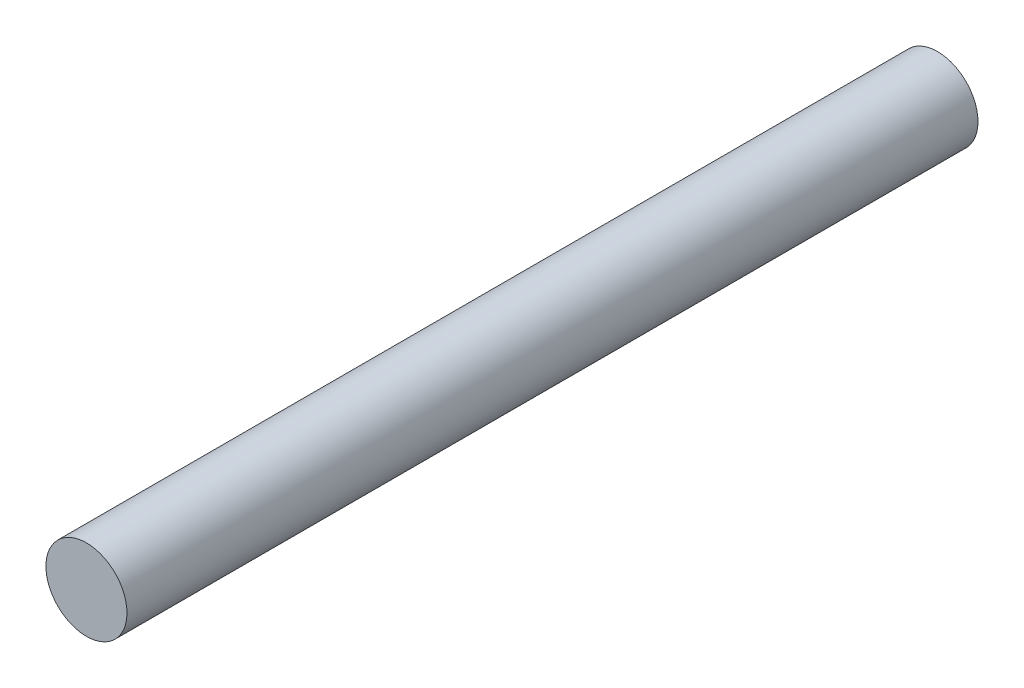
ISO-10303-21;
HEADER;
FILE_DESCRIPTION(('STEP AP214'),'2;1');
FILE_NAME('part.step','',(''),(''),'','','');
FILE_SCHEMA(('AUTOMOTIVE_DESIGN { 1 0 10303 214 1 1 1 1 }'));
ENDSEC;
DATA;
#1=APPLICATION_CONTEXT('core data for automotive mechanical design processes');
#2=APPLICATION_PROTOCOL_DEFINITION('international standard','automotive_design',2000,#1);
#3=PRODUCT_CONTEXT('',#1,'mechanical');
#4=PRODUCT('Part','Part','',(#3));
#5=PRODUCT_RELATED_PRODUCT_CATEGORY('part','',(#4));
#6=PRODUCT_DEFINITION_FORMATION('','',#4);
#7=PRODUCT_DEFINITION_CONTEXT('part definition',#1,'design');
#8=PRODUCT_DEFINITION('design','',#6,#7);
#9=PRODUCT_DEFINITION_SHAPE('','',#8);
#10=(LENGTH_UNIT() NAMED_UNIT(*) SI_UNIT(.MILLI.,.METRE.));
#11=(NAMED_UNIT(*) PLANE_ANGLE_UNIT() SI_UNIT($,.RADIAN.));
#12=(NAMED_UNIT(*) SI_UNIT($,.STERADIAN.) SOLID_ANGLE_UNIT());
#13=UNCERTAINTY_MEASURE_WITH_UNIT(LENGTH_MEASURE(1.E-05),#10,'distance_accuracy_value','');
#14=(GEOMETRIC_REPRESENTATION_CONTEXT(3) GLOBAL_UNCERTAINTY_ASSIGNED_CONTEXT((#13)) GLOBAL_UNIT_ASSIGNED_CONTEXT((#10,
#11,#12)) REPRESENTATION_CONTEXT('',''));
#15=CARTESIAN_POINT('',(0.,0.,0.));
#16=DIRECTION('',(0.,0.,1.));
#17=DIRECTION('',(1.,0.,0.));
#18=AXIS2_PLACEMENT_3D('',#15,#16,#17);
#19=CARTESIAN_POINT('',(0.,-1.08570103601838,266.7));
#20=DIRECTION('',(0.,0.,-1.));
#21=DIRECTION('',(-1.,0.,0.));
#22=AXIS2_PLACEMENT_3D('',#19,#20,#21);
#23=CYLINDRICAL_SURFACE('',#22,12.7);
#24=CARTESIAN_POINT('',(0.,-1.08570103601838,266.7));
#25=DIRECTION('',(0.,0.,1.));
#26=DIRECTION('',(1.,0.,0.));
#27=AXIS2_PLACEMENT_3D('',#24,#25,#26);
#28=CIRCLE('',#27,12.7);
#29=CARTESIAN_POINT('',(12.7,-1.08570103601838,266.7));
#30=VERTEX_POINT('',#29);
#31=EDGE_CURVE('E10',#30,#30,#28,.T.);
#32=ORIENTED_EDGE('',*,*,#31,.F.);
#33=EDGE_LOOP('',(#32));
#34=FACE_BOUND('',#33,.T.);
#35=CARTESIAN_POINT('',(0.,-1.08570103601838,0.));
#36=DIRECTION('',(0.,0.,1.));
#37=DIRECTION('',(1.,0.,0.));
#38=AXIS2_PLACEMENT_3D('',#35,#36,#37);
#39=CIRCLE('',#38,12.7);
#40=CARTESIAN_POINT('',(12.7,-1.08570103601838,0.));
#41=VERTEX_POINT('',#40);
#42=EDGE_CURVE('E40',#41,#41,#39,.T.);
#43=ORIENTED_EDGE('',*,*,#42,.T.);
#44=EDGE_LOOP('',(#43));
#45=FACE_BOUND('',#44,.T.);
#46=ADVANCED_FACE('F37',(#34,#45),#23,.T.);
#47=CARTESIAN_POINT('',(0.,-1.08570103601838,266.7));
#48=DIRECTION('',(0.,0.,1.));
#49=DIRECTION('',(1.,0.,0.));
#50=AXIS2_PLACEMENT_3D('',#47,#48,#49);
#51=PLANE('',#50);
#52=ORIENTED_EDGE('',*,*,#31,.T.);
#53=EDGE_LOOP('',(#52));
#54=FACE_BOUND('',#53,.T.);
#55=ADVANCED_FACE('F54',(#54),#51,.T.);
#56=CARTESIAN_POINT('',(0.,-1.08570103601838,0.));
#57=DIRECTION('',(0.,0.,1.));
#58=DIRECTION('',(1.,0.,0.));
#59=AXIS2_PLACEMENT_3D('',#56,#57,#58);
#60=PLANE('',#59);
#61=ORIENTED_EDGE('',*,*,#42,.F.);
#62=EDGE_LOOP('',(#61));
#63=FACE_BOUND('',#62,.T.);
#64=ADVANCED_FACE('F52',(#63),#60,.F.);
#65=CLOSED_SHELL('',(#46,#55,#64));
#66=MANIFOLD_SOLID_BREP('B2',#65);
#67=ADVANCED_BREP_SHAPE_REPRESENTATION('',(#18,#66),#14);
#68=SHAPE_DEFINITION_REPRESENTATION(#9,#67);
ENDSEC;
END-ISO-10303-21;
